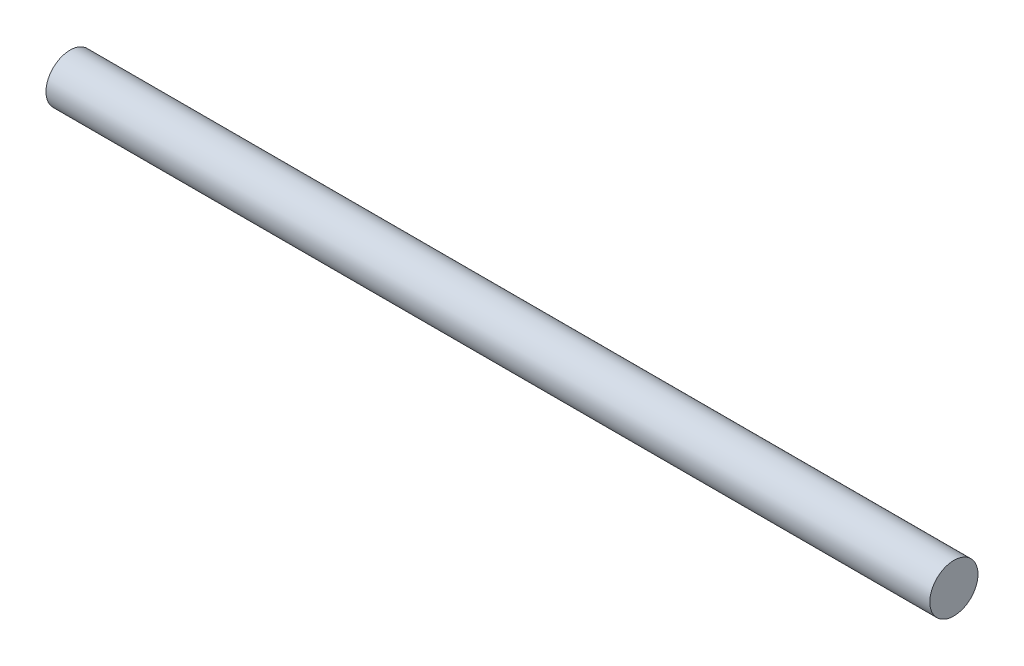
ISO-10303-21;
HEADER;
FILE_DESCRIPTION(('STEP AP214'),'2;1');
FILE_NAME('part.step','',(''),(''),'','','');
FILE_SCHEMA(('AUTOMOTIVE_DESIGN { 1 0 10303 214 1 1 1 1 }'));
ENDSEC;
DATA;
#1=APPLICATION_CONTEXT('core data for automotive mechanical design processes');
#2=APPLICATION_PROTOCOL_DEFINITION('international standard','automotive_design',2000,#1);
#3=PRODUCT_CONTEXT('',#1,'mechanical');
#4=PRODUCT('Part','Part','',(#3));
#5=PRODUCT_RELATED_PRODUCT_CATEGORY('part','',(#4));
#6=PRODUCT_DEFINITION_FORMATION('','',#4);
#7=PRODUCT_DEFINITION_CONTEXT('part definition',#1,'design');
#8=PRODUCT_DEFINITION('design','',#6,#7);
#9=PRODUCT_DEFINITION_SHAPE('','',#8);
#10=(LENGTH_UNIT() NAMED_UNIT(*) SI_UNIT(.MILLI.,.METRE.));
#11=(NAMED_UNIT(*) PLANE_ANGLE_UNIT() SI_UNIT($,.RADIAN.));
#12=(NAMED_UNIT(*) SI_UNIT($,.STERADIAN.) SOLID_ANGLE_UNIT());
#13=UNCERTAINTY_MEASURE_WITH_UNIT(LENGTH_MEASURE(1.E-05),#10,'distance_accuracy_value','');
#14=(GEOMETRIC_REPRESENTATION_CONTEXT(3) GLOBAL_UNCERTAINTY_ASSIGNED_CONTEXT((#13)) GLOBAL_UNIT_ASSIGNED_CONTEXT((#10,
#11,#12)) REPRESENTATION_CONTEXT('',''));
#15=CARTESIAN_POINT('',(0.,0.,0.));
#16=DIRECTION('',(0.,0.,1.));
#17=DIRECTION('',(1.,0.,0.));
#18=AXIS2_PLACEMENT_3D('',#15,#16,#17);
#19=CARTESIAN_POINT('',(27.5,0.,0.));
#20=DIRECTION('',(-1.,0.,0.));
#21=DIRECTION('',(0.,0.,1.));
#22=AXIS2_PLACEMENT_3D('',#19,#20,#21);
#23=CYLINDRICAL_SURFACE('',#22,1.5);
#24=CARTESIAN_POINT('',(27.5,0.,0.));
#25=DIRECTION('',(1.,0.,0.));
#26=DIRECTION('',(0.,0.,-1.));
#27=AXIS2_PLACEMENT_3D('',#24,#25,#26);
#28=CIRCLE('',#27,1.5);
#29=CARTESIAN_POINT('',(27.5,0.,-1.5));
#30=VERTEX_POINT('',#29);
#31=EDGE_CURVE('E10',#30,#30,#28,.T.);
#32=ORIENTED_EDGE('',*,*,#31,.F.);
#33=EDGE_LOOP('',(#32));
#34=FACE_BOUND('',#33,.T.);
#35=CARTESIAN_POINT('',(-27.5,0.,0.));
#36=DIRECTION('',(1.,0.,0.));
#37=DIRECTION('',(0.,0.,-1.));
#38=AXIS2_PLACEMENT_3D('',#35,#36,#37);
#39=CIRCLE('',#38,1.5);
#40=CARTESIAN_POINT('',(-27.5,0.,-1.5));
#41=VERTEX_POINT('',#40);
#42=EDGE_CURVE('E34',#41,#41,#39,.T.);
#43=ORIENTED_EDGE('',*,*,#42,.T.);
#44=EDGE_LOOP('',(#43));
#45=FACE_BOUND('',#44,.T.);
#46=ADVANCED_FACE('F31',(#34,#45),#23,.T.);
#47=CARTESIAN_POINT('',(27.5,0.,0.));
#48=DIRECTION('',(1.,0.,0.));
#49=DIRECTION('',(0.,0.,-1.));
#50=AXIS2_PLACEMENT_3D('',#47,#48,#49);
#51=PLANE('',#50);
#52=ORIENTED_EDGE('',*,*,#31,.T.);
#53=EDGE_LOOP('',(#52));
#54=FACE_BOUND('',#53,.T.);
#55=ADVANCED_FACE('F46',(#54),#51,.T.);
#56=CARTESIAN_POINT('',(-27.5,0.,0.));
#57=DIRECTION('',(1.,0.,0.));
#58=DIRECTION('',(0.,0.,-1.));
#59=AXIS2_PLACEMENT_3D('',#56,#57,#58);
#60=PLANE('',#59);
#61=ORIENTED_EDGE('',*,*,#42,.F.);
#62=EDGE_LOOP('',(#61));
#63=FACE_BOUND('',#62,.T.);
#64=ADVANCED_FACE('F44',(#63),#60,.F.);
#65=CLOSED_SHELL('',(#46,#55,#64));
#66=MANIFOLD_SOLID_BREP('B2',#65);
#67=ADVANCED_BREP_SHAPE_REPRESENTATION('',(#18,#66),#14);
#68=SHAPE_DEFINITION_REPRESENTATION(#9,#67);
ENDSEC;
END-ISO-10303-21;
